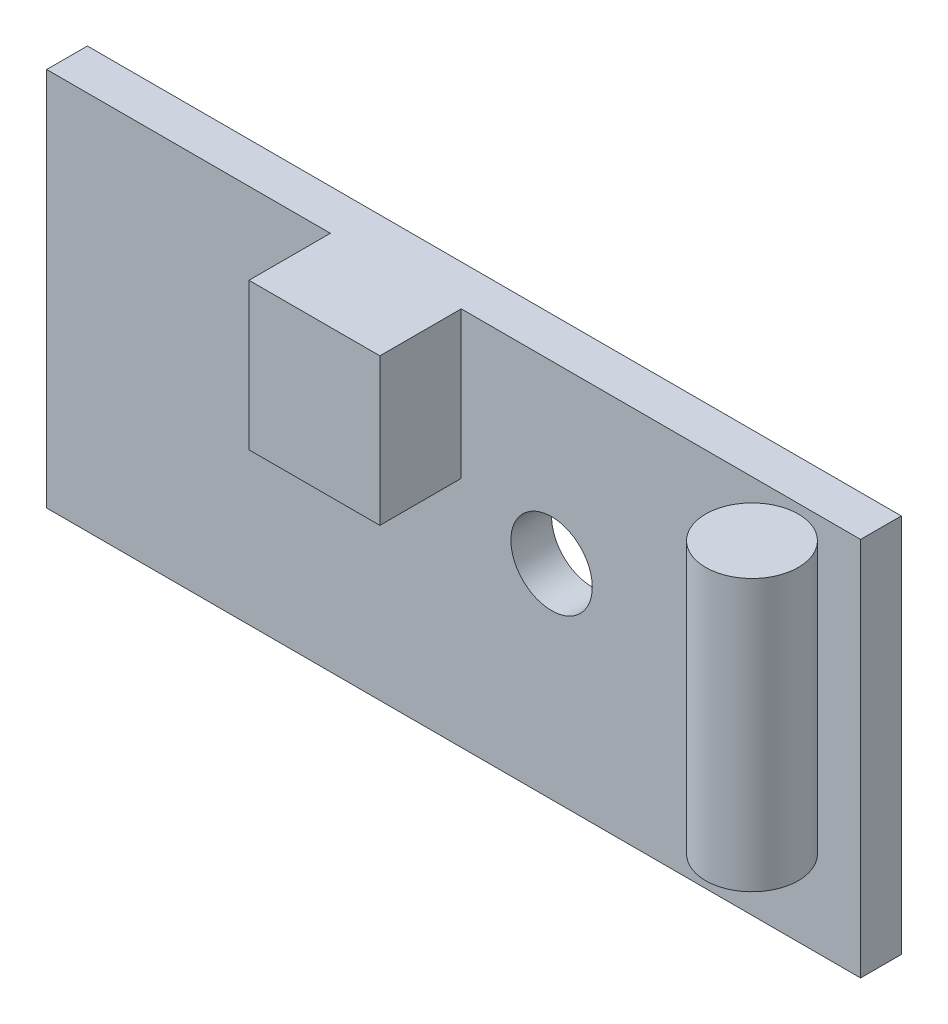
ISO-10303-21;
HEADER;
FILE_DESCRIPTION(('STEP AP214'),'2;1');
FILE_NAME('part.step','',(''),(''),'','','');
FILE_SCHEMA(('AUTOMOTIVE_DESIGN { 1 0 10303 214 1 1 1 1 }'));
ENDSEC;
DATA;
#1=APPLICATION_CONTEXT('core data for automotive mechanical design processes');
#2=APPLICATION_PROTOCOL_DEFINITION('international standard','automotive_design',2000,#1);
#3=PRODUCT_CONTEXT('',#1,'mechanical');
#4=PRODUCT('Part','Part','',(#3));
#5=PRODUCT_RELATED_PRODUCT_CATEGORY('part','',(#4));
#6=PRODUCT_DEFINITION_FORMATION('','',#4);
#7=PRODUCT_DEFINITION_CONTEXT('part definition',#1,'design');
#8=PRODUCT_DEFINITION('design','',#6,#7);
#9=PRODUCT_DEFINITION_SHAPE('','',#8);
#10=(LENGTH_UNIT() NAMED_UNIT(*) SI_UNIT(.MILLI.,.METRE.));
#11=(NAMED_UNIT(*) PLANE_ANGLE_UNIT() SI_UNIT($,.RADIAN.));
#12=(NAMED_UNIT(*) SI_UNIT($,.STERADIAN.) SOLID_ANGLE_UNIT());
#13=UNCERTAINTY_MEASURE_WITH_UNIT(LENGTH_MEASURE(1.E-05),#10,'distance_accuracy_value','');
#14=(GEOMETRIC_REPRESENTATION_CONTEXT(3) GLOBAL_UNCERTAINTY_ASSIGNED_CONTEXT((#13)) GLOBAL_UNIT_ASSIGNED_CONTEXT((#10,
#11,#12)) REPRESENTATION_CONTEXT('',''));
#15=CARTESIAN_POINT('',(0.,0.,0.));
#16=DIRECTION('',(0.,0.,1.));
#17=DIRECTION('',(1.,0.,0.));
#18=AXIS2_PLACEMENT_3D('',#15,#16,#17);
#19=CARTESIAN_POINT('',(184.559078960551,78.1843472270126,3.54317705949779));
#20=DIRECTION('',(0.,1.,0.));
#21=DIRECTION('',(0.,0.,1.));
#22=AXIS2_PLACEMENT_3D('',#19,#20,#21);
#23=CYLINDRICAL_SURFACE('',#22,1.70653385694946);
#24=CARTESIAN_POINT('',(184.559078960551,78.1843472270126,3.54317705949779));
#25=DIRECTION('',(0.,1.,0.));
#26=DIRECTION('',(0.,0.,1.));
#27=AXIS2_PLACEMENT_3D('',#24,#25,#26);
#28=CIRCLE('',#27,1.70653385694946);
#29=CARTESIAN_POINT('',(184.559078960551,78.1843472270126,5.24971091644726));
#30=VERTEX_POINT('',#29);
#31=EDGE_CURVE('E11',#30,#30,#28,.T.);
#32=ORIENTED_EDGE('',*,*,#31,.T.);
#33=EDGE_LOOP('',(#32));
#34=FACE_BOUND('',#33,.T.);
#35=CARTESIAN_POINT('',(184.559078960551,88.1843472270125,3.54317705949779));
#36=DIRECTION('',(0.,1.,0.));
#37=DIRECTION('',(0.,0.,1.));
#38=AXIS2_PLACEMENT_3D('',#35,#36,#37);
#39=CIRCLE('',#38,1.70653385694946);
#40=CARTESIAN_POINT('',(184.559078960551,88.1843472270125,5.24971091644726));
#41=VERTEX_POINT('',#40);
#42=EDGE_CURVE('E43',#41,#41,#39,.T.);
#43=ORIENTED_EDGE('',*,*,#42,.F.);
#44=EDGE_LOOP('',(#43));
#45=FACE_BOUND('',#44,.T.);
#46=ADVANCED_FACE('F40',(#34,#45),#23,.T.);
#47=CARTESIAN_POINT('',(184.559078960551,78.1843472270126,3.54317705949779));
#48=DIRECTION('',(0.,1.,0.));
#49=DIRECTION('',(0.,0.,1.));
#50=AXIS2_PLACEMENT_3D('',#47,#48,#49);
#51=PLANE('',#50);
#52=ORIENTED_EDGE('',*,*,#31,.F.);
#53=EDGE_LOOP('',(#52));
#54=FACE_BOUND('',#53,.T.);
#55=ADVANCED_FACE('F55',(#54),#51,.F.);
#56=CARTESIAN_POINT('',(184.559078960551,88.1843472270125,3.54317705949779));
#57=DIRECTION('',(0.,1.,0.));
#58=DIRECTION('',(0.,0.,1.));
#59=AXIS2_PLACEMENT_3D('',#56,#57,#58);
#60=PLANE('',#59);
#61=ORIENTED_EDGE('',*,*,#42,.T.);
#62=EDGE_LOOP('',(#61));
#63=FACE_BOUND('',#62,.T.);
#64=ADVANCED_FACE('F52',(#63),#60,.T.);
#65=CLOSED_SHELL('',(#46,#55,#64));
#66=MANIFOLD_SOLID_BREP('B2',#65);
#67=CARTESIAN_POINT('',(0.,0.,1.5));
#68=DIRECTION('',(0.,0.,-1.));
#69=DIRECTION('',(-1.,0.,0.));
#70=AXIS2_PLACEMENT_3D('',#67,#68,#69);
#71=PLANE('',#70);
#72=CARTESIAN_POINT('',(175.12844617526,81.715874023218,1.5));
#73=DIRECTION('',(0.,0.,1.));
#74=DIRECTION('',(1.,0.,0.));
#75=AXIS2_PLACEMENT_3D('',#72,#73,#74);
#76=CIRCLE('',#75,1.5);
#77=CARTESIAN_POINT('',(176.62844617526,81.715874023218,1.5));
#78=VERTEX_POINT('',#77);
#79=EDGE_CURVE('E170',#78,#78,#76,.T.);
#80=ORIENTED_EDGE('',*,*,#79,.F.);
#81=EDGE_LOOP('',(#80));
#82=FACE_BOUND('',#81,.T.);
#83=DIRECTION('',(0.,1.,0.));
#84=VECTOR('',#83,1.);
#85=CARTESIAN_POINT('',(171.798853876576,88.1843472270125,1.5));
#86=LINE('',#85,#84);
#87=CARTESIAN_POINT('',(171.798853876576,82.7722344339728,1.5));
#88=VERTEX_POINT('',#87);
#89=CARTESIAN_POINT('',(171.798853876576,88.1843472270125,1.5));
#90=VERTEX_POINT('',#89);
#91=EDGE_CURVE('E95',#88,#90,#86,.T.);
#92=ORIENTED_EDGE('',*,*,#91,.F.);
#93=DIRECTION('',(1.,0.,0.));
#94=VECTOR('',#93,1.);
#95=CARTESIAN_POINT('',(171.798853876576,82.7722344339728,1.5));
#96=LINE('',#95,#94);
#97=CARTESIAN_POINT('',(166.975014213214,82.7722344339728,1.5));
#98=VERTEX_POINT('',#97);
#99=EDGE_CURVE('E164',#98,#88,#96,.T.);
#100=ORIENTED_EDGE('',*,*,#99,.F.);
#101=DIRECTION('',(0.,-1.,0.));
#102=VECTOR('',#101,1.);
#103=CARTESIAN_POINT('',(166.975014213214,88.1843472270125,1.5));
#104=LINE('',#103,#102);
#105=CARTESIAN_POINT('',(166.975014213214,88.1843472270125,1.5));
#106=VERTEX_POINT('',#105);
#107=EDGE_CURVE('E101',#106,#98,#104,.T.);
#108=ORIENTED_EDGE('',*,*,#107,.F.);
#109=DIRECTION('',(-1.,0.,0.));
#110=VECTOR('',#109,1.);
#111=CARTESIAN_POINT('',(156.518802712405,88.1843472270125,1.5));
#112=LINE('',#111,#110);
#113=CARTESIAN_POINT('',(156.518802712405,88.1843472270125,1.5));
#114=VERTEX_POINT('',#113);
#115=EDGE_CURVE('E187',#106,#114,#112,.T.);
#116=ORIENTED_EDGE('',*,*,#115,.T.);
#117=DIRECTION('',(0.,-1.,0.));
#118=VECTOR('',#117,1.);
#119=CARTESIAN_POINT('',(156.518802712405,74.1843472270126,1.5));
#120=LINE('',#119,#118);
#121=CARTESIAN_POINT('',(156.518802712405,74.1843472270126,1.5));
#122=VERTEX_POINT('',#121);
#123=EDGE_CURVE('E179',#114,#122,#120,.T.);
#124=ORIENTED_EDGE('',*,*,#123,.T.);
#125=DIRECTION('',(1.,0.,0.));
#126=VECTOR('',#125,1.);
#127=CARTESIAN_POINT('',(156.518802712405,74.1843472270126,1.5));
#128=LINE('',#127,#126);
#129=CARTESIAN_POINT('',(186.518802712405,74.1843472270126,1.5));
#130=VERTEX_POINT('',#129);
#131=EDGE_CURVE('E182',#122,#130,#128,.T.);
#132=ORIENTED_EDGE('',*,*,#131,.T.);
#133=DIRECTION('',(0.,1.,0.));
#134=VECTOR('',#133,1.);
#135=CARTESIAN_POINT('',(186.518802712405,74.1843472270126,1.5));
#136=LINE('',#135,#134);
#137=CARTESIAN_POINT('',(186.518802712405,88.1843472270125,1.5));
#138=VERTEX_POINT('',#137);
#139=EDGE_CURVE('E185',#130,#138,#136,.T.);
#140=ORIENTED_EDGE('',*,*,#139,.T.);
#141=EDGE_CURVE('E188',#138,#90,#112,.T.);
#142=ORIENTED_EDGE('',*,*,#141,.T.);
#143=EDGE_LOOP('',(#92,#100,#108,#116,#124,#132,#140,#142));
#144=FACE_BOUND('',#143,.T.);
#145=ADVANCED_FACE('F80',(#82,#144),#71,.F.);
#146=CARTESIAN_POINT('',(0.,0.,0.));
#147=DIRECTION('',(0.,0.,-1.));
#148=DIRECTION('',(-1.,0.,0.));
#149=AXIS2_PLACEMENT_3D('',#146,#147,#148);
#150=PLANE('',#149);
#151=DIRECTION('',(0.,-1.,0.));
#152=VECTOR('',#151,1.);
#153=CARTESIAN_POINT('',(156.518802712405,74.1843472270126,0.));
#154=LINE('',#153,#152);
#155=CARTESIAN_POINT('',(156.518802712405,88.1843472270125,0.));
#156=VERTEX_POINT('',#155);
#157=CARTESIAN_POINT('',(156.518802712405,74.1843472270126,0.));
#158=VERTEX_POINT('',#157);
#159=EDGE_CURVE('E177',#156,#158,#154,.T.);
#160=ORIENTED_EDGE('',*,*,#159,.F.);
#161=DIRECTION('',(-1.,0.,0.));
#162=VECTOR('',#161,1.);
#163=CARTESIAN_POINT('',(156.518802712405,88.1843472270125,0.));
#164=LINE('',#163,#162);
#165=CARTESIAN_POINT('',(186.518802712405,88.1843472270125,0.));
#166=VERTEX_POINT('',#165);
#167=EDGE_CURVE('E183',#166,#156,#164,.T.);
#168=ORIENTED_EDGE('',*,*,#167,.F.);
#169=DIRECTION('',(0.,1.,0.));
#170=VECTOR('',#169,1.);
#171=CARTESIAN_POINT('',(186.518802712405,74.1843472270126,0.));
#172=LINE('',#171,#170);
#173=CARTESIAN_POINT('',(186.518802712405,74.1843472270126,0.));
#174=VERTEX_POINT('',#173);
#175=EDGE_CURVE('E195',#174,#166,#172,.T.);
#176=ORIENTED_EDGE('',*,*,#175,.F.);
#177=DIRECTION('',(1.,0.,0.));
#178=VECTOR('',#177,1.);
#179=CARTESIAN_POINT('',(156.518802712405,74.1843472270126,0.));
#180=LINE('',#179,#178);
#181=EDGE_CURVE('E193',#158,#174,#180,.T.);
#182=ORIENTED_EDGE('',*,*,#181,.F.);
#183=EDGE_LOOP('',(#160,#168,#176,#182));
#184=FACE_BOUND('',#183,.T.);
#185=CARTESIAN_POINT('',(175.12844617526,81.715874023218,0.));
#186=DIRECTION('',(0.,0.,1.));
#187=DIRECTION('',(1.,0.,0.));
#188=AXIS2_PLACEMENT_3D('',#185,#186,#187);
#189=CIRCLE('',#188,1.5);
#190=CARTESIAN_POINT('',(176.62844617526,81.715874023218,0.));
#191=VERTEX_POINT('',#190);
#192=EDGE_CURVE('E167',#191,#191,#189,.T.);
#193=ORIENTED_EDGE('',*,*,#192,.T.);
#194=EDGE_LOOP('',(#193));
#195=FACE_BOUND('',#194,.T.);
#196=ADVANCED_FACE('F213',(#184,#195),#150,.T.);
#197=CARTESIAN_POINT('',(156.518802712405,74.1843472270126,1.5));
#198=DIRECTION('',(1.,0.,0.));
#199=DIRECTION('',(0.,0.,-1.));
#200=AXIS2_PLACEMENT_3D('',#197,#198,#199);
#201=PLANE('',#200);
#202=ORIENTED_EDGE('',*,*,#159,.T.);
#203=DIRECTION('',(0.,0.,-1.));
#204=VECTOR('',#203,1.);
#205=CARTESIAN_POINT('',(156.518802712405,74.1843472270126,1.5));
#206=LINE('',#205,#204);
#207=EDGE_CURVE('E38',#122,#158,#206,.T.);
#208=ORIENTED_EDGE('',*,*,#207,.F.);
#209=ORIENTED_EDGE('',*,*,#123,.F.);
#210=DIRECTION('',(0.,0.,-1.));
#211=VECTOR('',#210,1.);
#212=CARTESIAN_POINT('',(156.518802712405,88.1843472270125,1.5));
#213=LINE('',#212,#211);
#214=EDGE_CURVE('E190',#114,#156,#213,.T.);
#215=ORIENTED_EDGE('',*,*,#214,.T.);
#216=EDGE_LOOP('',(#202,#208,#209,#215));
#217=FACE_BOUND('',#216,.T.);
#218=ADVANCED_FACE('F82',(#217),#201,.F.);
#219=CARTESIAN_POINT('',(156.518802712405,74.1843472270126,1.5));
#220=DIRECTION('',(0.,1.,0.));
#221=DIRECTION('',(0.,0.,1.));
#222=AXIS2_PLACEMENT_3D('',#219,#220,#221);
#223=PLANE('',#222);
#224=ORIENTED_EDGE('',*,*,#181,.T.);
#225=DIRECTION('',(0.,0.,-1.));
#226=VECTOR('',#225,1.);
#227=CARTESIAN_POINT('',(186.518802712405,74.1843472270126,1.5));
#228=LINE('',#227,#226);
#229=EDGE_CURVE('E88',#130,#174,#228,.T.);
#230=ORIENTED_EDGE('',*,*,#229,.F.);
#231=ORIENTED_EDGE('',*,*,#131,.F.);
#232=ORIENTED_EDGE('',*,*,#207,.T.);
#233=EDGE_LOOP('',(#224,#230,#231,#232));
#234=FACE_BOUND('',#233,.T.);
#235=ADVANCED_FACE('F255',(#234),#223,.F.);
#236=CARTESIAN_POINT('',(186.518802712405,74.1843472270126,1.5));
#237=DIRECTION('',(-1.,0.,0.));
#238=DIRECTION('',(0.,0.,1.));
#239=AXIS2_PLACEMENT_3D('',#236,#237,#238);
#240=PLANE('',#239);
#241=ORIENTED_EDGE('',*,*,#175,.T.);
#242=DIRECTION('',(0.,0.,-1.));
#243=VECTOR('',#242,1.);
#244=CARTESIAN_POINT('',(186.518802712405,88.1843472270125,1.5));
#245=LINE('',#244,#243);
#246=EDGE_CURVE('E200',#138,#166,#245,.T.);
#247=ORIENTED_EDGE('',*,*,#246,.F.);
#248=ORIENTED_EDGE('',*,*,#139,.F.);
#249=ORIENTED_EDGE('',*,*,#229,.T.);
#250=EDGE_LOOP('',(#241,#247,#248,#249));
#251=FACE_BOUND('',#250,.T.);
#252=ADVANCED_FACE('F207',(#251),#240,.F.);
#253=CARTESIAN_POINT('',(156.518802712405,88.1843472270125,1.5));
#254=DIRECTION('',(0.,-1.,0.));
#255=DIRECTION('',(0.,0.,-1.));
#256=AXIS2_PLACEMENT_3D('',#253,#254,#255);
#257=PLANE('',#256);
#258=ORIENTED_EDGE('',*,*,#167,.T.);
#259=ORIENTED_EDGE('',*,*,#214,.F.);
#260=ORIENTED_EDGE('',*,*,#115,.F.);
#261=DIRECTION('',(0.,0.,-1.));
#262=VECTOR('',#261,1.);
#263=CARTESIAN_POINT('',(166.975014213214,88.1843472270125,4.5));
#264=LINE('',#263,#262);
#265=CARTESIAN_POINT('',(166.975014213214,88.1843472270125,4.5));
#266=VERTEX_POINT('',#265);
#267=EDGE_CURVE('E151',#266,#106,#264,.T.);
#268=ORIENTED_EDGE('',*,*,#267,.F.);
#269=DIRECTION('',(-1.,0.,0.));
#270=VECTOR('',#269,1.);
#271=CARTESIAN_POINT('',(171.798853876576,88.1843472270125,4.5));
#272=LINE('',#271,#270);
#273=CARTESIAN_POINT('',(171.798853876576,88.1843472270125,4.5));
#274=VERTEX_POINT('',#273);
#275=EDGE_CURVE('E144',#274,#266,#272,.T.);
#276=ORIENTED_EDGE('',*,*,#275,.F.);
#277=DIRECTION('',(0.,0.,-1.));
#278=VECTOR('',#277,1.);
#279=CARTESIAN_POINT('',(171.798853876576,88.1843472270125,4.5));
#280=LINE('',#279,#278);
#281=EDGE_CURVE('E149',#274,#90,#280,.T.);
#282=ORIENTED_EDGE('',*,*,#281,.T.);
#283=ORIENTED_EDGE('',*,*,#141,.F.);
#284=ORIENTED_EDGE('',*,*,#246,.T.);
#285=EDGE_LOOP('',(#258,#259,#260,#268,#276,#282,#283,#284));
#286=FACE_BOUND('',#285,.T.);
#287=ADVANCED_FACE('F146',(#286),#257,.F.);
#288=CARTESIAN_POINT('',(175.12844617526,81.715874023218,1.5));
#289=DIRECTION('',(0.,0.,-1.));
#290=DIRECTION('',(-1.,0.,0.));
#291=AXIS2_PLACEMENT_3D('',#288,#289,#290);
#292=CYLINDRICAL_SURFACE('',#291,1.5);
#293=ORIENTED_EDGE('',*,*,#79,.T.);
#294=EDGE_LOOP('',(#293));
#295=FACE_BOUND('',#294,.T.);
#296=ORIENTED_EDGE('',*,*,#192,.F.);
#297=EDGE_LOOP('',(#296));
#298=FACE_BOUND('',#297,.T.);
#299=ADVANCED_FACE('F249',(#295,#298),#292,.F.);
#300=CARTESIAN_POINT('',(171.798853876576,88.1843472270125,4.5));
#301=DIRECTION('',(-1.,0.,0.));
#302=DIRECTION('',(0.,0.,1.));
#303=AXIS2_PLACEMENT_3D('',#300,#301,#302);
#304=PLANE('',#303);
#305=ORIENTED_EDGE('',*,*,#91,.T.);
#306=ORIENTED_EDGE('',*,*,#281,.F.);
#307=DIRECTION('',(0.,1.,0.));
#308=VECTOR('',#307,1.);
#309=CARTESIAN_POINT('',(171.798853876576,88.1843472270125,4.5));
#310=LINE('',#309,#308);
#311=CARTESIAN_POINT('',(171.798853876576,82.7722344339728,4.5));
#312=VERTEX_POINT('',#311);
#313=EDGE_CURVE('E155',#312,#274,#310,.T.);
#314=ORIENTED_EDGE('',*,*,#313,.F.);
#315=DIRECTION('',(0.,0.,-1.));
#316=VECTOR('',#315,1.);
#317=CARTESIAN_POINT('',(171.798853876576,82.7722344339728,4.5));
#318=LINE('',#317,#316);
#319=EDGE_CURVE('E224',#312,#88,#318,.T.);
#320=ORIENTED_EDGE('',*,*,#319,.T.);
#321=EDGE_LOOP('',(#305,#306,#314,#320));
#322=FACE_BOUND('',#321,.T.);
#323=ADVANCED_FACE('F166',(#322),#304,.F.);
#324=CARTESIAN_POINT('',(166.975014213214,88.1843472270125,4.5));
#325=DIRECTION('',(1.,0.,0.));
#326=DIRECTION('',(0.,0.,-1.));
#327=AXIS2_PLACEMENT_3D('',#324,#325,#326);
#328=PLANE('',#327);
#329=ORIENTED_EDGE('',*,*,#107,.T.);
#330=DIRECTION('',(0.,0.,-1.));
#331=VECTOR('',#330,1.);
#332=CARTESIAN_POINT('',(166.975014213214,82.7722344339728,4.5));
#333=LINE('',#332,#331);
#334=CARTESIAN_POINT('',(166.975014213214,82.7722344339728,4.5));
#335=VERTEX_POINT('',#334);
#336=EDGE_CURVE('E172',#335,#98,#333,.T.);
#337=ORIENTED_EDGE('',*,*,#336,.F.);
#338=DIRECTION('',(0.,-1.,0.));
#339=VECTOR('',#338,1.);
#340=CARTESIAN_POINT('',(166.975014213214,88.1843472270125,4.5));
#341=LINE('',#340,#339);
#342=EDGE_CURVE('E154',#266,#335,#341,.T.);
#343=ORIENTED_EDGE('',*,*,#342,.F.);
#344=ORIENTED_EDGE('',*,*,#267,.T.);
#345=EDGE_LOOP('',(#329,#337,#343,#344));
#346=FACE_BOUND('',#345,.T.);
#347=ADVANCED_FACE('F220',(#346),#328,.F.);
#348=CARTESIAN_POINT('',(171.798853876576,82.7722344339728,4.5));
#349=DIRECTION('',(0.,1.,0.));
#350=DIRECTION('',(0.,0.,1.));
#351=AXIS2_PLACEMENT_3D('',#348,#349,#350);
#352=PLANE('',#351);
#353=ORIENTED_EDGE('',*,*,#99,.T.);
#354=ORIENTED_EDGE('',*,*,#319,.F.);
#355=DIRECTION('',(1.,0.,0.));
#356=VECTOR('',#355,1.);
#357=CARTESIAN_POINT('',(171.798853876576,82.7722344339728,4.5));
#358=LINE('',#357,#356);
#359=EDGE_CURVE('E160',#335,#312,#358,.T.);
#360=ORIENTED_EDGE('',*,*,#359,.F.);
#361=ORIENTED_EDGE('',*,*,#336,.T.);
#362=EDGE_LOOP('',(#353,#354,#360,#361));
#363=FACE_BOUND('',#362,.T.);
#364=ADVANCED_FACE('F231',(#363),#352,.F.);
#365=CARTESIAN_POINT('',(0.,0.,4.5));
#366=DIRECTION('',(0.,0.,-1.));
#367=DIRECTION('',(-1.,0.,0.));
#368=AXIS2_PLACEMENT_3D('',#365,#366,#367);
#369=PLANE('',#368);
#370=ORIENTED_EDGE('',*,*,#313,.T.);
#371=ORIENTED_EDGE('',*,*,#275,.T.);
#372=ORIENTED_EDGE('',*,*,#342,.T.);
#373=ORIENTED_EDGE('',*,*,#359,.T.);
#374=EDGE_LOOP('',(#370,#371,#372,#373));
#375=FACE_BOUND('',#374,.T.);
#376=ADVANCED_FACE('F158',(#375),#369,.F.);
#377=CLOSED_SHELL('',(#145,#196,#218,#235,#252,#287,#299,#323,#347,#364,#376));
#378=MANIFOLD_SOLID_BREP('B6',#377);
#379=ADVANCED_BREP_SHAPE_REPRESENTATION('',(#18,#66,#378),#14);
#380=SHAPE_DEFINITION_REPRESENTATION(#9,#379);
ENDSEC;
END-ISO-10303-21;
